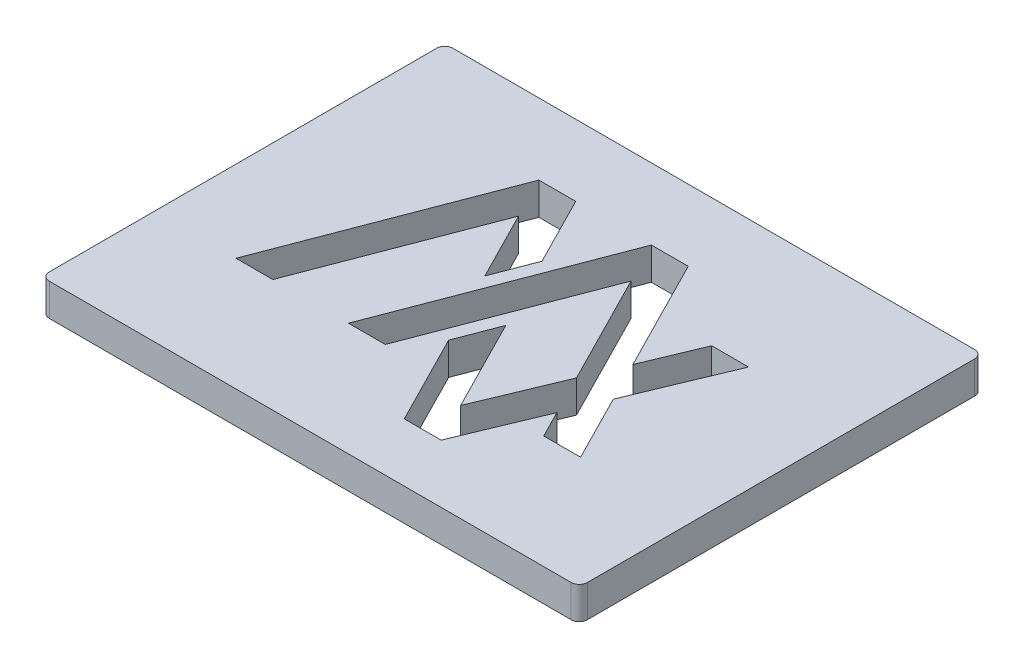
ISO-10303-21;
HEADER;
FILE_DESCRIPTION(('STEP AP214'),'2;1');
FILE_NAME('part.step','',(''),(''),'','','');
FILE_SCHEMA(('AUTOMOTIVE_DESIGN { 1 0 10303 214 1 1 1 1 }'));
ENDSEC;
DATA;
#1=APPLICATION_CONTEXT('core data for automotive mechanical design processes');
#2=APPLICATION_PROTOCOL_DEFINITION('international standard','automotive_design',2000,#1);
#3=PRODUCT_CONTEXT('',#1,'mechanical');
#4=PRODUCT('Part','Part','',(#3));
#5=PRODUCT_RELATED_PRODUCT_CATEGORY('part','',(#4));
#6=PRODUCT_DEFINITION_FORMATION('','',#4);
#7=PRODUCT_DEFINITION_CONTEXT('part definition',#1,'design');
#8=PRODUCT_DEFINITION('design','',#6,#7);
#9=PRODUCT_DEFINITION_SHAPE('','',#8);
#10=(LENGTH_UNIT() NAMED_UNIT(*) SI_UNIT(.MILLI.,.METRE.));
#11=(NAMED_UNIT(*) PLANE_ANGLE_UNIT() SI_UNIT($,.RADIAN.));
#12=(NAMED_UNIT(*) SI_UNIT($,.STERADIAN.) SOLID_ANGLE_UNIT());
#13=UNCERTAINTY_MEASURE_WITH_UNIT(LENGTH_MEASURE(1.E-05),#10,'distance_accuracy_value','');
#14=(GEOMETRIC_REPRESENTATION_CONTEXT(3) GLOBAL_UNCERTAINTY_ASSIGNED_CONTEXT((#13)) GLOBAL_UNIT_ASSIGNED_CONTEXT((#10,
#11,#12)) REPRESENTATION_CONTEXT('',''));
#15=CARTESIAN_POINT('',(0.,0.,0.));
#16=DIRECTION('',(0.,0.,1.));
#17=DIRECTION('',(1.,0.,0.));
#18=AXIS2_PLACEMENT_3D('',#15,#16,#17);
#19=CARTESIAN_POINT('',(97.,12.,-72.));
#20=DIRECTION('',(0.,-1.,0.));
#21=DIRECTION('',(0.,0.,-1.));
#22=AXIS2_PLACEMENT_3D('',#19,#20,#21);
#23=PLANE('',#22);
#24=DIRECTION('',(0.453552085785202,0.,0.891229771428162));
#25=VECTOR('',#24,1.);
#26=CARTESIAN_POINT('',(-0.117996716516434,12.,0.0600492247987563));
#27=LINE('',#26,#25);
#28=CARTESIAN_POINT('',(-24.8559068113444,12.,-48.5499399041352));
#29=VERTEX_POINT('',#28);
#30=CARTESIAN_POINT('',(-11.8569764432542,12.,-23.0070439416851));
#31=VERTEX_POINT('',#30);
#32=EDGE_CURVE('E135',#29,#31,#27,.T.);
#33=ORIENTED_EDGE('',*,*,#32,.T.);
#34=DIRECTION('',(-0.357011262554827,0.,0.934100079439569));
#35=VECTOR('',#34,1.);
#36=CARTESIAN_POINT('',(-18.0182080675893,12.,-6.88652463775086));
#37=LINE('',#36,#35);
#38=CARTESIAN_POINT('',(-17.7329616051894,12.,-7.63285611558958));
#39=VERTEX_POINT('',#38);
#40=EDGE_CURVE('E476',#31,#39,#37,.T.);
#41=ORIENTED_EDGE('',*,*,#40,.T.);
#42=DIRECTION('',(0.453552085785201,0.,0.891229771428162));
#43=VECTOR('',#42,1.);
#44=CARTESIAN_POINT('',(-10.999776641591,12.,5.5978511927068));
#45=LINE('',#44,#43);
#46=CARTESIAN_POINT('',(-30.7318919732795,12.,-33.1757520780395));
#47=VERTEX_POINT('',#46);
#48=EDGE_CURVE('E506',#47,#39,#45,.T.);
#49=ORIENTED_EDGE('',*,*,#48,.F.);
#50=DIRECTION('',(0.357011262554827,0.,-0.934100079439569));
#51=VECTOR('',#50,1.);
#52=CARTESIAN_POINT('',(-37.8784866971146,12.,-14.4770851186701));
#53=LINE('',#52,#51);
#54=CARTESIAN_POINT('',(-55.995225818357,12.,32.9243535116856));
#55=VERTEX_POINT('',#54);
#56=EDGE_CURVE('E503',#55,#47,#53,.T.);
#57=ORIENTED_EDGE('',*,*,#56,.F.);
#58=DIRECTION('',(1.,0.,0.));
#59=VECTOR('',#58,1.);
#60=CARTESIAN_POINT('',(0.,12.,32.9243535116856));
#61=LINE('',#60,#59);
#62=CARTESIAN_POINT('',(-69.695225818357,12.,32.9243535116856));
#63=VERTEX_POINT('',#62);
#64=EDGE_CURVE('E500',#63,#55,#61,.T.);
#65=ORIENTED_EDGE('',*,*,#64,.F.);
#66=DIRECTION('',(0.357011262554827,0.,-0.934100079439569));
#67=VECTOR('',#66,1.);
#68=CARTESIAN_POINT('',(-49.832325227318,12.,-19.0458193260421));
#69=LINE('',#68,#67);
#70=CARTESIAN_POINT('',(-38.5559068113443,12.,-48.5499399041352));
#71=VERTEX_POINT('',#70);
#72=EDGE_CURVE('E497',#63,#71,#69,.T.);
#73=ORIENTED_EDGE('',*,*,#72,.T.);
#74=DIRECTION('',(1.,0.,0.));
#75=VECTOR('',#74,1.);
#76=CARTESIAN_POINT('',(0.,12.,-48.5499399041352));
#77=LINE('',#76,#75);
#78=EDGE_CURVE('E494',#71,#29,#77,.T.);
#79=ORIENTED_EDGE('',*,*,#78,.T.);
#80=EDGE_LOOP('',(#33,#41,#49,#57,#65,#73,#79));
#81=FACE_BOUND('',#80,.T.);
#82=CARTESIAN_POINT('',(97.,12.,-72.));
#83=DIRECTION('',(0.,1.,0.));
#84=DIRECTION('',(0.,0.,-1.));
#85=AXIS2_PLACEMENT_3D('',#82,#83,#84);
#86=CIRCLE('',#85,3.);
#87=CARTESIAN_POINT('',(100.,12.,-72.));
#88=VERTEX_POINT('',#87);
#89=CARTESIAN_POINT('',(96.9999999999999,12.,-75.));
#90=VERTEX_POINT('',#89);
#91=EDGE_CURVE('E525',#88,#90,#86,.T.);
#92=ORIENTED_EDGE('',*,*,#91,.T.);
#93=DIRECTION('',(-1.,0.,0.));
#94=VECTOR('',#93,1.);
#95=CARTESIAN_POINT('',(-97.,12.,-75.));
#96=LINE('',#95,#94);
#97=CARTESIAN_POINT('',(-97.,12.,-75.));
#98=VERTEX_POINT('',#97);
#99=EDGE_CURVE('E528',#90,#98,#96,.T.);
#100=ORIENTED_EDGE('',*,*,#99,.T.);
#101=CARTESIAN_POINT('',(-97.,12.,-72.));
#102=DIRECTION('',(0.,1.,0.));
#103=DIRECTION('',(0.,0.,-1.));
#104=AXIS2_PLACEMENT_3D('',#101,#102,#103);
#105=CIRCLE('',#104,3.);
#106=CARTESIAN_POINT('',(-100.,12.,-72.));
#107=VERTEX_POINT('',#106);
#108=EDGE_CURVE('E531',#98,#107,#105,.T.);
#109=ORIENTED_EDGE('',*,*,#108,.T.);
#110=DIRECTION('',(0.,0.,1.));
#111=VECTOR('',#110,1.);
#112=CARTESIAN_POINT('',(-100.,12.,72.));
#113=LINE('',#112,#111);
#114=CARTESIAN_POINT('',(-100.,12.,72.));
#115=VERTEX_POINT('',#114);
#116=EDGE_CURVE('E533',#107,#115,#113,.T.);
#117=ORIENTED_EDGE('',*,*,#116,.T.);
#118=CARTESIAN_POINT('',(-97.,12.,72.));
#119=DIRECTION('',(0.,1.,0.));
#120=DIRECTION('',(0.,0.,-1.));
#121=AXIS2_PLACEMENT_3D('',#118,#119,#120);
#122=CIRCLE('',#121,3.);
#123=CARTESIAN_POINT('',(-97.,12.,75.));
#124=VERTEX_POINT('',#123);
#125=EDGE_CURVE('E535',#115,#124,#122,.T.);
#126=ORIENTED_EDGE('',*,*,#125,.T.);
#127=DIRECTION('',(1.,0.,0.));
#128=VECTOR('',#127,1.);
#129=CARTESIAN_POINT('',(-97.,12.,75.));
#130=LINE('',#129,#128);
#131=CARTESIAN_POINT('',(96.9999999999999,12.,75.));
#132=VERTEX_POINT('',#131);
#133=EDGE_CURVE('E537',#124,#132,#130,.T.);
#134=ORIENTED_EDGE('',*,*,#133,.T.);
#135=CARTESIAN_POINT('',(97.,12.,72.));
#136=DIRECTION('',(0.,1.,0.));
#137=DIRECTION('',(0.,0.,1.));
#138=AXIS2_PLACEMENT_3D('',#135,#136,#137);
#139=CIRCLE('',#138,3.);
#140=CARTESIAN_POINT('',(100.,12.,72.));
#141=VERTEX_POINT('',#140);
#142=EDGE_CURVE('E539',#132,#141,#139,.T.);
#143=ORIENTED_EDGE('',*,*,#142,.T.);
#144=DIRECTION('',(0.,0.,-1.));
#145=VECTOR('',#144,1.);
#146=CARTESIAN_POINT('',(100.,12.,72.));
#147=LINE('',#146,#145);
#148=EDGE_CURVE('E541',#141,#88,#147,.T.);
#149=ORIENTED_EDGE('',*,*,#148,.T.);
#150=EDGE_LOOP('',(#92,#100,#109,#117,#126,#134,#143,#149));
#151=FACE_BOUND('',#150,.T.);
#152=DIRECTION('',(0.453552085785202,0.,0.891229771428162));
#153=VECTOR('',#152,1.);
#154=CARTESIAN_POINT('',(33.094563240844,12.,-16.8420183742089));
#155=LINE('',#154,#153);
#156=CARTESIAN_POINT('',(45.8172414528804,12.,8.15804214858021));
#157=VERTEX_POINT('',#156);
#158=CARTESIAN_POINT('',(58.42096333926,12.,32.9243535116856));
#159=VERTEX_POINT('',#158);
#160=EDGE_CURVE('E127',#157,#159,#155,.T.);
#161=ORIENTED_EDGE('',*,*,#160,.T.);
#162=DIRECTION('',(1.,0.,0.));
#163=VECTOR('',#162,1.);
#164=CARTESIAN_POINT('',(0.,12.,32.9243535116856));
#165=LINE('',#164,#163);
#166=CARTESIAN_POINT('',(44.72096333926,12.,32.9243535116856));
#167=VERTEX_POINT('',#166);
#168=EDGE_CURVE('E350',#167,#159,#165,.T.);
#169=ORIENTED_EDGE('',*,*,#168,.F.);
#170=DIRECTION('',(0.453552085785202,0.,0.891229771428162));
#171=VECTOR('',#170,1.);
#172=CARTESIAN_POINT('',(22.2127833157694,12.,-11.3042164063008));
#173=LINE('',#172,#171);
#174=CARTESIAN_POINT('',(39.6515482353747,12.,22.9629536947529));
#175=VERTEX_POINT('',#174);
#176=EDGE_CURVE('E353',#175,#167,#173,.T.);
#177=ORIENTED_EDGE('',*,*,#176,.F.);
#178=DIRECTION('',(0.384454930284693,0.,-0.923143762682602));
#179=VECTOR('',#178,1.);
#180=CARTESIAN_POINT('',(41.9405445502991,12.,17.4666718045423));
#181=LINE('',#180,#179);
#182=CARTESIAN_POINT('',(26.9987708465014,12.,53.3444928741317));
#183=VERTEX_POINT('',#182);
#184=EDGE_CURVE('E435',#183,#175,#181,.T.);
#185=ORIENTED_EDGE('',*,*,#184,.F.);
#186=DIRECTION('',(1.,0.,0.));
#187=VECTOR('',#186,1.);
#188=CARTESIAN_POINT('',(0.,12.,53.3444928741317));
#189=LINE('',#188,#187);
#190=CARTESIAN_POINT('',(13.2987708465014,12.,53.3444928741317));
#191=VERTEX_POINT('',#190);
#192=EDGE_CURVE('E432',#191,#183,#189,.T.);
#193=ORIENTED_EDGE('',*,*,#192,.F.);
#194=DIRECTION('',(0.453552085785202,0.,0.891229771428162));
#195=VECTOR('',#194,1.);
#196=CARTESIAN_POINT('',(-10.999776641591,12.,5.5978511927068));
#197=LINE('',#196,#195);
#198=CARTESIAN_POINT('',(-3.79508395786317,12.,19.7550710908639));
#199=VERTEX_POINT('',#198);
#200=EDGE_CURVE('E429',#199,#191,#197,.T.);
#201=ORIENTED_EDGE('',*,*,#200,.F.);
#202=DIRECTION('',(-0.357011262554827,0.,0.934100079439569));
#203=VECTOR('',#202,1.);
#204=CARTESIAN_POINT('',(3.27663125700978,12.,1.2523221951694));
#205=LINE('',#204,#203);
#206=CARTESIAN_POINT('',(2.08090120407204,12.,4.38088326476839));
#207=VERTEX_POINT('',#206);
#208=EDGE_CURVE('E426',#207,#199,#205,.T.);
#209=ORIENTED_EDGE('',*,*,#208,.F.);
#210=DIRECTION('',(0.453552085785202,0.,0.891229771428162));
#211=VECTOR('',#210,1.);
#212=CARTESIAN_POINT('',(-0.117996716516432,12.,0.0600492247987554));
#213=LINE('',#212,#211);
#214=CARTESIAN_POINT('',(19.4644640640072,12.,38.5395813279591));
#215=VERTEX_POINT('',#214);
#216=EDGE_CURVE('E423',#207,#215,#213,.T.);
#217=ORIENTED_EDGE('',*,*,#216,.T.);
#218=DIRECTION('',(0.384454930284693,0.,-0.923143762682602));
#219=VECTOR('',#218,1.);
#220=CARTESIAN_POINT('',(30.2654811801559,12.,12.6044435628713));
#221=LINE('',#220,#219);
#222=CARTESIAN_POINT('',(32.1172414528804,12.,8.15804214858022));
#223=VERTEX_POINT('',#222);
#224=EDGE_CURVE('E420',#215,#223,#221,.T.);
#225=ORIENTED_EDGE('',*,*,#224,.T.);
#226=DIRECTION('',(0.453552085785202,0.,0.891229771428162));
#227=VECTOR('',#226,1.);
#228=CARTESIAN_POINT('',(22.2127833157694,12.,-11.3042164063008));
#229=LINE('',#228,#227);
#230=CARTESIAN_POINT('',(11.0822298476707,12.,-33.1757520780397));
#231=VERTEX_POINT('',#230);
#232=EDGE_CURVE('E417',#231,#223,#229,.T.);
#233=ORIENTED_EDGE('',*,*,#232,.F.);
#234=DIRECTION('',(0.357011262554827,0.,-0.934100079439569));
#235=VECTOR('',#234,1.);
#236=CARTESIAN_POINT('',(-1.39386914018807,12.,-0.532734117604737));
#237=LINE('',#236,#235);
#238=CARTESIAN_POINT('',(-14.1811039974068,12.,32.9243535116856));
#239=VERTEX_POINT('',#238);
#240=EDGE_CURVE('E414',#239,#231,#237,.T.);
#241=ORIENTED_EDGE('',*,*,#240,.F.);
#242=DIRECTION('',(1.,0.,0.));
#243=VECTOR('',#242,1.);
#244=CARTESIAN_POINT('',(0.,12.,32.9243535116856));
#245=LINE('',#244,#243);
#246=CARTESIAN_POINT('',(-27.8811039974068,12.,32.9243535116856));
#247=VERTEX_POINT('',#246);
#248=EDGE_CURVE('E411',#247,#239,#245,.T.);
#249=ORIENTED_EDGE('',*,*,#248,.F.);
#250=DIRECTION('',(0.357011262554827,0.,-0.934100079439569));
#251=VECTOR('',#250,1.);
#252=CARTESIAN_POINT('',(-13.3477076703915,12.,-5.10146832497673));
#253=LINE('',#252,#251);
#254=CARTESIAN_POINT('',(3.25821500960587,12.,-48.5499399041352));
#255=VERTEX_POINT('',#254);
#256=EDGE_CURVE('E408',#247,#255,#253,.T.);
#257=ORIENTED_EDGE('',*,*,#256,.T.);
#258=DIRECTION('',(1.,0.,0.));
#259=VECTOR('',#258,1.);
#260=CARTESIAN_POINT('',(0.,12.,-48.5499399041352));
#261=LINE('',#260,#259);
#262=CARTESIAN_POINT('',(16.9582150096059,12.,-48.5499399041352));
#263=VERTEX_POINT('',#262);
#264=EDGE_CURVE('E405',#255,#263,#261,.T.);
#265=ORIENTED_EDGE('',*,*,#264,.T.);
#266=DIRECTION('',(0.453552085785202,0.,0.891229771428162));
#267=VECTOR('',#266,1.);
#268=CARTESIAN_POINT('',(33.094563240844,12.,-16.8420183742089));
#269=LINE('',#268,#267);
#270=CARTESIAN_POINT('',(38.2829346703861,12.,-6.64686939759242));
#271=VERTEX_POINT('',#270);
#272=EDGE_CURVE('E402',#263,#271,#269,.T.);
#273=ORIENTED_EDGE('',*,*,#272,.T.);
#274=DIRECTION('',(0.384454930284694,0.,-0.923143762682602));
#275=VECTOR('',#274,1.);
#276=CARTESIAN_POINT('',(30.2654811801559,12.,12.6044435628713));
#277=LINE('',#276,#275);
#278=CARTESIAN_POINT('',(46.8992769107267,12.,-27.3362193570764));
#279=VERTEX_POINT('',#278);
#280=EDGE_CURVE('E399',#271,#279,#277,.T.);
#281=ORIENTED_EDGE('',*,*,#280,.T.);
#282=DIRECTION('',(1.,0.,0.));
#283=VECTOR('',#282,1.);
#284=CARTESIAN_POINT('',(0.,12.,-27.3362193570764));
#285=LINE('',#284,#283);
#286=CARTESIAN_POINT('',(60.5992769107267,12.,-27.3362193570764));
#287=VERTEX_POINT('',#286);
#288=EDGE_CURVE('E396',#279,#287,#285,.T.);
#289=ORIENTED_EDGE('',*,*,#288,.T.);
#290=DIRECTION('',(0.384454930284693,0.,-0.923143762682602));
#291=VECTOR('',#290,1.);
#292=CARTESIAN_POINT('',(41.9405445502991,12.,17.4666718045423));
#293=LINE('',#292,#291);
#294=EDGE_CURVE('E394',#157,#287,#293,.T.);
#295=ORIENTED_EDGE('',*,*,#294,.F.);
#296=EDGE_LOOP('',(#161,#169,#177,#185,#193,#201,#209,#217,#225,#233,#241,#249,#257,#265,#273,
#281,#289,#295));
#297=FACE_BOUND('',#296,.T.);
#298=ADVANCED_FACE('F112',(#81,#151,#297),#23,.F.);
#299=CARTESIAN_POINT('',(97.,0.,-72.));
#300=DIRECTION('',(0.,-1.,0.));
#301=DIRECTION('',(0.,0.,-1.));
#302=AXIS2_PLACEMENT_3D('',#299,#300,#301);
#303=PLANE('',#302);
#304=CARTESIAN_POINT('',(97.,0.,-72.));
#305=DIRECTION('',(0.,1.,0.));
#306=DIRECTION('',(0.,0.,-1.));
#307=AXIS2_PLACEMENT_3D('',#304,#305,#306);
#308=CIRCLE('',#307,3.);
#309=CARTESIAN_POINT('',(100.,0.,-72.));
#310=VERTEX_POINT('',#309);
#311=CARTESIAN_POINT('',(96.9999999999999,0.,-75.));
#312=VERTEX_POINT('',#311);
#313=EDGE_CURVE('E513',#310,#312,#308,.T.);
#314=ORIENTED_EDGE('',*,*,#313,.F.);
#315=DIRECTION('',(0.,0.,-1.));
#316=VECTOR('',#315,1.);
#317=CARTESIAN_POINT('',(100.,0.,72.));
#318=LINE('',#317,#316);
#319=CARTESIAN_POINT('',(100.,0.,72.));
#320=VERTEX_POINT('',#319);
#321=EDGE_CURVE('E529',#320,#310,#318,.T.);
#322=ORIENTED_EDGE('',*,*,#321,.F.);
#323=CARTESIAN_POINT('',(97.,0.,72.));
#324=DIRECTION('',(0.,1.,0.));
#325=DIRECTION('',(0.,0.,1.));
#326=AXIS2_PLACEMENT_3D('',#323,#324,#325);
#327=CIRCLE('',#326,3.);
#328=CARTESIAN_POINT('',(96.9999999999999,0.,75.));
#329=VERTEX_POINT('',#328);
#330=EDGE_CURVE('E556',#329,#320,#327,.T.);
#331=ORIENTED_EDGE('',*,*,#330,.F.);
#332=DIRECTION('',(1.,0.,0.));
#333=VECTOR('',#332,1.);
#334=CARTESIAN_POINT('',(-97.,0.,75.));
#335=LINE('',#334,#333);
#336=CARTESIAN_POINT('',(-97.,0.,75.));
#337=VERTEX_POINT('',#336);
#338=EDGE_CURVE('E554',#337,#329,#335,.T.);
#339=ORIENTED_EDGE('',*,*,#338,.F.);
#340=CARTESIAN_POINT('',(-97.,0.,72.));
#341=DIRECTION('',(0.,1.,0.));
#342=DIRECTION('',(0.,0.,-1.));
#343=AXIS2_PLACEMENT_3D('',#340,#341,#342);
#344=CIRCLE('',#343,3.);
#345=CARTESIAN_POINT('',(-100.,0.,72.));
#346=VERTEX_POINT('',#345);
#347=EDGE_CURVE('E552',#346,#337,#344,.T.);
#348=ORIENTED_EDGE('',*,*,#347,.F.);
#349=DIRECTION('',(0.,0.,1.));
#350=VECTOR('',#349,1.);
#351=CARTESIAN_POINT('',(-100.,0.,72.));
#352=LINE('',#351,#350);
#353=CARTESIAN_POINT('',(-100.,0.,-72.));
#354=VERTEX_POINT('',#353);
#355=EDGE_CURVE('E550',#354,#346,#352,.T.);
#356=ORIENTED_EDGE('',*,*,#355,.F.);
#357=CARTESIAN_POINT('',(-97.,0.,-72.));
#358=DIRECTION('',(0.,1.,0.));
#359=DIRECTION('',(0.,0.,-1.));
#360=AXIS2_PLACEMENT_3D('',#357,#358,#359);
#361=CIRCLE('',#360,3.);
#362=CARTESIAN_POINT('',(-97.,0.,-75.));
#363=VERTEX_POINT('',#362);
#364=EDGE_CURVE('E548',#363,#354,#361,.T.);
#365=ORIENTED_EDGE('',*,*,#364,.F.);
#366=DIRECTION('',(-1.,0.,0.));
#367=VECTOR('',#366,1.);
#368=CARTESIAN_POINT('',(-97.,0.,-75.));
#369=LINE('',#368,#367);
#370=EDGE_CURVE('E546',#312,#363,#369,.T.);
#371=ORIENTED_EDGE('',*,*,#370,.F.);
#372=EDGE_LOOP('',(#314,#322,#331,#339,#348,#356,#365,#371));
#373=FACE_BOUND('',#372,.T.);
#374=DIRECTION('',(-0.357011262554827,0.,0.934100079439569));
#375=VECTOR('',#374,1.);
#376=CARTESIAN_POINT('',(-18.0182080675893,0.,-6.88652463775086));
#377=LINE('',#376,#375);
#378=CARTESIAN_POINT('',(-11.8569764432542,0.,-23.0070439416851));
#379=VERTEX_POINT('',#378);
#380=CARTESIAN_POINT('',(-17.7329616051894,0.,-7.63285611558958));
#381=VERTEX_POINT('',#380);
#382=EDGE_CURVE('E490',#379,#381,#377,.T.);
#383=ORIENTED_EDGE('',*,*,#382,.F.);
#384=DIRECTION('',(0.453552085785202,0.,0.891229771428162));
#385=VECTOR('',#384,1.);
#386=CARTESIAN_POINT('',(-0.117996716516434,0.,0.0600492247987563));
#387=LINE('',#386,#385);
#388=CARTESIAN_POINT('',(-24.8559068113444,0.,-48.5499399041352));
#389=VERTEX_POINT('',#388);
#390=EDGE_CURVE('E473',#389,#379,#387,.T.);
#391=ORIENTED_EDGE('',*,*,#390,.F.);
#392=DIRECTION('',(1.,0.,0.));
#393=VECTOR('',#392,1.);
#394=CARTESIAN_POINT('',(0.,0.,-48.5499399041352));
#395=LINE('',#394,#393);
#396=CARTESIAN_POINT('',(-38.5559068113443,0.,-48.5499399041352));
#397=VERTEX_POINT('',#396);
#398=EDGE_CURVE('E475',#397,#389,#395,.T.);
#399=ORIENTED_EDGE('',*,*,#398,.F.);
#400=DIRECTION('',(0.357011262554827,0.,-0.934100079439569));
#401=VECTOR('',#400,1.);
#402=CARTESIAN_POINT('',(-49.832325227318,0.,-19.0458193260421));
#403=LINE('',#402,#401);
#404=CARTESIAN_POINT('',(-69.695225818357,0.,32.9243535116856));
#405=VERTEX_POINT('',#404);
#406=EDGE_CURVE('E478',#405,#397,#403,.T.);
#407=ORIENTED_EDGE('',*,*,#406,.F.);
#408=DIRECTION('',(1.,0.,0.));
#409=VECTOR('',#408,1.);
#410=CARTESIAN_POINT('',(0.,0.,32.9243535116856));
#411=LINE('',#410,#409);
#412=CARTESIAN_POINT('',(-55.995225818357,0.,32.9243535116856));
#413=VERTEX_POINT('',#412);
#414=EDGE_CURVE('E481',#405,#413,#411,.T.);
#415=ORIENTED_EDGE('',*,*,#414,.T.);
#416=DIRECTION('',(0.357011262554827,0.,-0.934100079439569));
#417=VECTOR('',#416,1.);
#418=CARTESIAN_POINT('',(-37.8784866971146,0.,-14.4770851186701));
#419=LINE('',#418,#417);
#420=CARTESIAN_POINT('',(-30.7318919732795,0.,-33.1757520780395));
#421=VERTEX_POINT('',#420);
#422=EDGE_CURVE('E484',#413,#421,#419,.T.);
#423=ORIENTED_EDGE('',*,*,#422,.T.);
#424=DIRECTION('',(0.453552085785201,0.,0.891229771428162));
#425=VECTOR('',#424,1.);
#426=CARTESIAN_POINT('',(-10.999776641591,0.,5.5978511927068));
#427=LINE('',#426,#425);
#428=EDGE_CURVE('E487',#421,#381,#427,.T.);
#429=ORIENTED_EDGE('',*,*,#428,.T.);
#430=EDGE_LOOP('',(#383,#391,#399,#407,#415,#423,#429));
#431=FACE_BOUND('',#430,.T.);
#432=DIRECTION('',(1.,0.,0.));
#433=VECTOR('',#432,1.);
#434=CARTESIAN_POINT('',(0.,0.,32.9243535116856));
#435=LINE('',#434,#433);
#436=CARTESIAN_POINT('',(44.72096333926,0.,32.9243535116856));
#437=VERTEX_POINT('',#436);
#438=CARTESIAN_POINT('',(58.42096333926,0.,32.9243535116856));
#439=VERTEX_POINT('',#438);
#440=EDGE_CURVE('E336',#437,#439,#435,.T.);
#441=ORIENTED_EDGE('',*,*,#440,.T.);
#442=DIRECTION('',(0.453552085785202,0.,0.891229771428162));
#443=VECTOR('',#442,1.);
#444=CARTESIAN_POINT('',(33.094563240844,0.,-16.8420183742089));
#445=LINE('',#444,#443);
#446=CARTESIAN_POINT('',(45.8172414528804,0.,8.15804214858021));
#447=VERTEX_POINT('',#446);
#448=EDGE_CURVE('E330',#447,#439,#445,.T.);
#449=ORIENTED_EDGE('',*,*,#448,.F.);
#450=DIRECTION('',(0.384454930284693,0.,-0.923143762682602));
#451=VECTOR('',#450,1.);
#452=CARTESIAN_POINT('',(41.9405445502991,0.,17.4666718045423));
#453=LINE('',#452,#451);
#454=CARTESIAN_POINT('',(60.5992769107267,0.,-27.3362193570764));
#455=VERTEX_POINT('',#454);
#456=EDGE_CURVE('E339',#447,#455,#453,.T.);
#457=ORIENTED_EDGE('',*,*,#456,.T.);
#458=DIRECTION('',(1.,0.,0.));
#459=VECTOR('',#458,1.);
#460=CARTESIAN_POINT('',(0.,0.,-27.3362193570764));
#461=LINE('',#460,#459);
#462=CARTESIAN_POINT('',(46.8992769107267,0.,-27.3362193570764));
#463=VERTEX_POINT('',#462);
#464=EDGE_CURVE('E344',#463,#455,#461,.T.);
#465=ORIENTED_EDGE('',*,*,#464,.F.);
#466=DIRECTION('',(0.384454930284694,0.,-0.923143762682602));
#467=VECTOR('',#466,1.);
#468=CARTESIAN_POINT('',(30.2654811801559,0.,12.6044435628713));
#469=LINE('',#468,#467);
#470=CARTESIAN_POINT('',(38.2829346703861,0.,-6.64686939759242));
#471=VERTEX_POINT('',#470);
#472=EDGE_CURVE('E357',#471,#463,#469,.T.);
#473=ORIENTED_EDGE('',*,*,#472,.F.);
#474=DIRECTION('',(0.453552085785202,0.,0.891229771428162));
#475=VECTOR('',#474,1.);
#476=CARTESIAN_POINT('',(33.094563240844,0.,-16.8420183742089));
#477=LINE('',#476,#475);
#478=CARTESIAN_POINT('',(16.9582150096059,0.,-48.5499399041352));
#479=VERTEX_POINT('',#478);
#480=EDGE_CURVE('E359',#479,#471,#477,.T.);
#481=ORIENTED_EDGE('',*,*,#480,.F.);
#482=DIRECTION('',(1.,0.,0.));
#483=VECTOR('',#482,1.);
#484=CARTESIAN_POINT('',(0.,0.,-48.5499399041352));
#485=LINE('',#484,#483);
#486=CARTESIAN_POINT('',(3.25821500960587,0.,-48.5499399041352));
#487=VERTEX_POINT('',#486);
#488=EDGE_CURVE('E361',#487,#479,#485,.T.);
#489=ORIENTED_EDGE('',*,*,#488,.F.);
#490=DIRECTION('',(0.357011262554827,0.,-0.934100079439569));
#491=VECTOR('',#490,1.);
#492=CARTESIAN_POINT('',(-13.3477076703915,0.,-5.10146832497673));
#493=LINE('',#492,#491);
#494=CARTESIAN_POINT('',(-27.8811039974068,0.,32.9243535116856));
#495=VERTEX_POINT('',#494);
#496=EDGE_CURVE('E363',#495,#487,#493,.T.);
#497=ORIENTED_EDGE('',*,*,#496,.F.);
#498=DIRECTION('',(1.,0.,0.));
#499=VECTOR('',#498,1.);
#500=CARTESIAN_POINT('',(0.,0.,32.9243535116856));
#501=LINE('',#500,#499);
#502=CARTESIAN_POINT('',(-14.1811039974068,0.,32.9243535116856));
#503=VERTEX_POINT('',#502);
#504=EDGE_CURVE('E365',#495,#503,#501,.T.);
#505=ORIENTED_EDGE('',*,*,#504,.T.);
#506=DIRECTION('',(0.357011262554827,0.,-0.934100079439569));
#507=VECTOR('',#506,1.);
#508=CARTESIAN_POINT('',(-1.39386914018807,0.,-0.532734117604737));
#509=LINE('',#508,#507);
#510=CARTESIAN_POINT('',(11.0822298476707,0.,-33.1757520780397));
#511=VERTEX_POINT('',#510);
#512=EDGE_CURVE('E368',#503,#511,#509,.T.);
#513=ORIENTED_EDGE('',*,*,#512,.T.);
#514=DIRECTION('',(0.453552085785202,0.,0.891229771428162));
#515=VECTOR('',#514,1.);
#516=CARTESIAN_POINT('',(22.2127833157694,0.,-11.3042164063008));
#517=LINE('',#516,#515);
#518=CARTESIAN_POINT('',(32.1172414528804,0.,8.15804214858022));
#519=VERTEX_POINT('',#518);
#520=EDGE_CURVE('E371',#511,#519,#517,.T.);
#521=ORIENTED_EDGE('',*,*,#520,.T.);
#522=DIRECTION('',(0.384454930284693,0.,-0.923143762682602));
#523=VECTOR('',#522,1.);
#524=CARTESIAN_POINT('',(30.2654811801559,0.,12.6044435628713));
#525=LINE('',#524,#523);
#526=CARTESIAN_POINT('',(19.4644640640072,0.,38.5395813279591));
#527=VERTEX_POINT('',#526);
#528=EDGE_CURVE('E374',#527,#519,#525,.T.);
#529=ORIENTED_EDGE('',*,*,#528,.F.);
#530=DIRECTION('',(0.453552085785202,0.,0.891229771428162));
#531=VECTOR('',#530,1.);
#532=CARTESIAN_POINT('',(-0.117996716516432,0.,0.0600492247987554));
#533=LINE('',#532,#531);
#534=CARTESIAN_POINT('',(2.08090120407204,0.,4.38088326476839));
#535=VERTEX_POINT('',#534);
#536=EDGE_CURVE('E376',#535,#527,#533,.T.);
#537=ORIENTED_EDGE('',*,*,#536,.F.);
#538=DIRECTION('',(-0.357011262554827,0.,0.934100079439569));
#539=VECTOR('',#538,1.);
#540=CARTESIAN_POINT('',(3.27663125700978,0.,1.2523221951694));
#541=LINE('',#540,#539);
#542=CARTESIAN_POINT('',(-3.79508395786317,0.,19.7550710908639));
#543=VERTEX_POINT('',#542);
#544=EDGE_CURVE('E378',#535,#543,#541,.T.);
#545=ORIENTED_EDGE('',*,*,#544,.T.);
#546=DIRECTION('',(0.453552085785202,0.,0.891229771428162));
#547=VECTOR('',#546,1.);
#548=CARTESIAN_POINT('',(-10.999776641591,0.,5.5978511927068));
#549=LINE('',#548,#547);
#550=CARTESIAN_POINT('',(13.2987708465014,0.,53.3444928741317));
#551=VERTEX_POINT('',#550);
#552=EDGE_CURVE('E381',#543,#551,#549,.T.);
#553=ORIENTED_EDGE('',*,*,#552,.T.);
#554=DIRECTION('',(1.,0.,0.));
#555=VECTOR('',#554,1.);
#556=CARTESIAN_POINT('',(0.,0.,53.3444928741317));
#557=LINE('',#556,#555);
#558=CARTESIAN_POINT('',(26.9987708465014,0.,53.3444928741317));
#559=VERTEX_POINT('',#558);
#560=EDGE_CURVE('E384',#551,#559,#557,.T.);
#561=ORIENTED_EDGE('',*,*,#560,.T.);
#562=DIRECTION('',(0.384454930284693,0.,-0.923143762682602));
#563=VECTOR('',#562,1.);
#564=CARTESIAN_POINT('',(41.9405445502991,0.,17.4666718045423));
#565=LINE('',#564,#563);
#566=CARTESIAN_POINT('',(39.6515482353747,0.,22.9629536947529));
#567=VERTEX_POINT('',#566);
#568=EDGE_CURVE('E387',#559,#567,#565,.T.);
#569=ORIENTED_EDGE('',*,*,#568,.T.);
#570=DIRECTION('',(0.453552085785202,0.,0.891229771428162));
#571=VECTOR('',#570,1.);
#572=CARTESIAN_POINT('',(22.2127833157694,0.,-11.3042164063008));
#573=LINE('',#572,#571);
#574=EDGE_CURVE('E390',#567,#437,#573,.T.);
#575=ORIENTED_EDGE('',*,*,#574,.T.);
#576=EDGE_LOOP('',(#441,#449,#457,#465,#473,#481,#489,#497,#505,#513,#521,#529,#537,#545,#553,
#561,#569,#575));
#577=FACE_BOUND('',#576,.T.);
#578=ADVANCED_FACE('F347',(#373,#431,#577),#303,.T.);
#579=CARTESIAN_POINT('',(97.,12.,-72.));
#580=DIRECTION('',(0.,-1.,0.));
#581=DIRECTION('',(0.,0.,-1.));
#582=AXIS2_PLACEMENT_3D('',#579,#580,#581);
#583=CYLINDRICAL_SURFACE('',#582,3.);
#584=ORIENTED_EDGE('',*,*,#313,.T.);
#585=DIRECTION('',(0.,-1.,0.));
#586=VECTOR('',#585,1.);
#587=CARTESIAN_POINT('',(96.9999999999999,12.,-75.));
#588=LINE('',#587,#586);
#589=EDGE_CURVE('E12',#90,#312,#588,.T.);
#590=ORIENTED_EDGE('',*,*,#589,.F.);
#591=ORIENTED_EDGE('',*,*,#91,.F.);
#592=DIRECTION('',(0.,-1.,0.));
#593=VECTOR('',#592,1.);
#594=CARTESIAN_POINT('',(100.,12.,-72.));
#595=LINE('',#594,#593);
#596=EDGE_CURVE('E543',#88,#310,#595,.T.);
#597=ORIENTED_EDGE('',*,*,#596,.T.);
#598=EDGE_LOOP('',(#584,#590,#591,#597));
#599=FACE_BOUND('',#598,.T.);
#600=ADVANCED_FACE('F114',(#599),#583,.T.);
#601=CARTESIAN_POINT('',(-97.,12.,-75.));
#602=DIRECTION('',(0.,0.,1.));
#603=DIRECTION('',(1.,0.,0.));
#604=AXIS2_PLACEMENT_3D('',#601,#602,#603);
#605=PLANE('',#604);
#606=ORIENTED_EDGE('',*,*,#370,.T.);
#607=DIRECTION('',(0.,-1.,0.));
#608=VECTOR('',#607,1.);
#609=CARTESIAN_POINT('',(-97.,12.,-75.));
#610=LINE('',#609,#608);
#611=EDGE_CURVE('E120',#98,#363,#610,.T.);
#612=ORIENTED_EDGE('',*,*,#611,.F.);
#613=ORIENTED_EDGE('',*,*,#99,.F.);
#614=ORIENTED_EDGE('',*,*,#589,.T.);
#615=EDGE_LOOP('',(#606,#612,#613,#614));
#616=FACE_BOUND('',#615,.T.);
#617=ADVANCED_FACE('F603',(#616),#605,.F.);
#618=CARTESIAN_POINT('',(-97.,12.,-72.));
#619=DIRECTION('',(0.,-1.,0.));
#620=DIRECTION('',(0.,0.,-1.));
#621=AXIS2_PLACEMENT_3D('',#618,#619,#620);
#622=CYLINDRICAL_SURFACE('',#621,3.);
#623=ORIENTED_EDGE('',*,*,#364,.T.);
#624=DIRECTION('',(0.,-1.,0.));
#625=VECTOR('',#624,1.);
#626=CARTESIAN_POINT('',(-100.,12.,-72.));
#627=LINE('',#626,#625);
#628=EDGE_CURVE('E573',#107,#354,#627,.T.);
#629=ORIENTED_EDGE('',*,*,#628,.F.);
#630=ORIENTED_EDGE('',*,*,#108,.F.);
#631=ORIENTED_EDGE('',*,*,#611,.T.);
#632=EDGE_LOOP('',(#623,#629,#630,#631));
#633=FACE_BOUND('',#632,.T.);
#634=ADVANCED_FACE('F580',(#633),#622,.T.);
#635=CARTESIAN_POINT('',(-100.,12.,72.));
#636=DIRECTION('',(1.,0.,0.));
#637=DIRECTION('',(0.,0.,-1.));
#638=AXIS2_PLACEMENT_3D('',#635,#636,#637);
#639=PLANE('',#638);
#640=ORIENTED_EDGE('',*,*,#355,.T.);
#641=DIRECTION('',(0.,-1.,0.));
#642=VECTOR('',#641,1.);
#643=CARTESIAN_POINT('',(-100.,12.,72.));
#644=LINE('',#643,#642);
#645=EDGE_CURVE('E570',#115,#346,#644,.T.);
#646=ORIENTED_EDGE('',*,*,#645,.F.);
#647=ORIENTED_EDGE('',*,*,#116,.F.);
#648=ORIENTED_EDGE('',*,*,#628,.T.);
#649=EDGE_LOOP('',(#640,#646,#647,#648));
#650=FACE_BOUND('',#649,.T.);
#651=ADVANCED_FACE('F591',(#650),#639,.F.);
#652=CARTESIAN_POINT('',(-97.,12.,72.));
#653=DIRECTION('',(0.,-1.,0.));
#654=DIRECTION('',(0.,0.,-1.));
#655=AXIS2_PLACEMENT_3D('',#652,#653,#654);
#656=CYLINDRICAL_SURFACE('',#655,3.);
#657=ORIENTED_EDGE('',*,*,#347,.T.);
#658=DIRECTION('',(0.,-1.,0.));
#659=VECTOR('',#658,1.);
#660=CARTESIAN_POINT('',(-97.,12.,75.));
#661=LINE('',#660,#659);
#662=EDGE_CURVE('E567',#124,#337,#661,.T.);
#663=ORIENTED_EDGE('',*,*,#662,.F.);
#664=ORIENTED_EDGE('',*,*,#125,.F.);
#665=ORIENTED_EDGE('',*,*,#645,.T.);
#666=EDGE_LOOP('',(#657,#663,#664,#665));
#667=FACE_BOUND('',#666,.T.);
#668=ADVANCED_FACE('F595',(#667),#656,.T.);
#669=CARTESIAN_POINT('',(-97.,12.,75.));
#670=DIRECTION('',(0.,0.,-1.));
#671=DIRECTION('',(-1.,0.,0.));
#672=AXIS2_PLACEMENT_3D('',#669,#670,#671);
#673=PLANE('',#672);
#674=ORIENTED_EDGE('',*,*,#338,.T.);
#675=DIRECTION('',(0.,-1.,0.));
#676=VECTOR('',#675,1.);
#677=CARTESIAN_POINT('',(96.9999999999999,12.,75.));
#678=LINE('',#677,#676);
#679=EDGE_CURVE('E564',#132,#329,#678,.T.);
#680=ORIENTED_EDGE('',*,*,#679,.F.);
#681=ORIENTED_EDGE('',*,*,#133,.F.);
#682=ORIENTED_EDGE('',*,*,#662,.T.);
#683=EDGE_LOOP('',(#674,#680,#681,#682));
#684=FACE_BOUND('',#683,.T.);
#685=ADVANCED_FACE('F616',(#684),#673,.F.);
#686=CARTESIAN_POINT('',(97.,12.,72.));
#687=DIRECTION('',(0.,-1.,0.));
#688=DIRECTION('',(0.,0.,-1.));
#689=AXIS2_PLACEMENT_3D('',#686,#687,#688);
#690=CYLINDRICAL_SURFACE('',#689,3.);
#691=ORIENTED_EDGE('',*,*,#330,.T.);
#692=DIRECTION('',(0.,-1.,0.));
#693=VECTOR('',#692,1.);
#694=CARTESIAN_POINT('',(100.,12.,72.));
#695=LINE('',#694,#693);
#696=EDGE_CURVE('E561',#141,#320,#695,.T.);
#697=ORIENTED_EDGE('',*,*,#696,.F.);
#698=ORIENTED_EDGE('',*,*,#142,.F.);
#699=ORIENTED_EDGE('',*,*,#679,.T.);
#700=EDGE_LOOP('',(#691,#697,#698,#699));
#701=FACE_BOUND('',#700,.T.);
#702=ADVANCED_FACE('F614',(#701),#690,.T.);
#703=CARTESIAN_POINT('',(100.,12.,72.));
#704=DIRECTION('',(-1.,0.,0.));
#705=DIRECTION('',(0.,0.,1.));
#706=AXIS2_PLACEMENT_3D('',#703,#704,#705);
#707=PLANE('',#706);
#708=ORIENTED_EDGE('',*,*,#321,.T.);
#709=ORIENTED_EDGE('',*,*,#596,.F.);
#710=ORIENTED_EDGE('',*,*,#148,.F.);
#711=ORIENTED_EDGE('',*,*,#696,.T.);
#712=EDGE_LOOP('',(#708,#709,#710,#711));
#713=FACE_BOUND('',#712,.T.);
#714=ADVANCED_FACE('F609',(#713),#707,.F.);
#715=CARTESIAN_POINT('',(-0.117996716516434,0.,0.0600492247987563));
#716=DIRECTION('',(-0.891229771428162,0.,0.453552085785201));
#717=DIRECTION('',(0.453552085785201,0.,0.891229771428162));
#718=AXIS2_PLACEMENT_3D('',#715,#716,#717);
#719=PLANE('',#718);
#720=ORIENTED_EDGE('',*,*,#32,.F.);
#721=DIRECTION('',(0.,1.,0.));
#722=VECTOR('',#721,1.);
#723=CARTESIAN_POINT('',(-24.8559068113444,0.,-48.5499399041352));
#724=LINE('',#723,#722);
#725=EDGE_CURVE('E492',#389,#29,#724,.T.);
#726=ORIENTED_EDGE('',*,*,#725,.F.);
#727=ORIENTED_EDGE('',*,*,#390,.T.);
#728=DIRECTION('',(0.,1.,0.));
#729=VECTOR('',#728,1.);
#730=CARTESIAN_POINT('',(-11.8569764432542,0.,-23.0070439416851));
#731=LINE('',#730,#729);
#732=EDGE_CURVE('E511',#379,#31,#731,.T.);
#733=ORIENTED_EDGE('',*,*,#732,.T.);
#734=EDGE_LOOP('',(#720,#726,#727,#733));
#735=FACE_BOUND('',#734,.T.);
#736=ADVANCED_FACE('F633',(#735),#719,.T.);
#737=CARTESIAN_POINT('',(-18.0182080675893,0.,-6.88652463775086));
#738=DIRECTION('',(-0.934100079439569,0.,-0.357011262554827));
#739=DIRECTION('',(-0.357011262554827,0.,0.934100079439569));
#740=AXIS2_PLACEMENT_3D('',#737,#738,#739);
#741=PLANE('',#740);
#742=ORIENTED_EDGE('',*,*,#40,.F.);
#743=ORIENTED_EDGE('',*,*,#732,.F.);
#744=ORIENTED_EDGE('',*,*,#382,.T.);
#745=DIRECTION('',(0.,1.,0.));
#746=VECTOR('',#745,1.);
#747=CARTESIAN_POINT('',(-17.7329616051894,0.,-7.63285611558958));
#748=LINE('',#747,#746);
#749=EDGE_CURVE('E514',#381,#39,#748,.T.);
#750=ORIENTED_EDGE('',*,*,#749,.T.);
#751=EDGE_LOOP('',(#742,#743,#744,#750));
#752=FACE_BOUND('',#751,.T.);
#753=ADVANCED_FACE('F640',(#752),#741,.T.);
#754=CARTESIAN_POINT('',(-10.999776641591,0.,5.5978511927068));
#755=DIRECTION('',(-0.891229771428162,0.,0.453552085785201));
#756=DIRECTION('',(0.453552085785202,0.,0.891229771428162));
#757=AXIS2_PLACEMENT_3D('',#754,#755,#756);
#758=PLANE('',#757);
#759=ORIENTED_EDGE('',*,*,#48,.T.);
#760=ORIENTED_EDGE('',*,*,#749,.F.);
#761=ORIENTED_EDGE('',*,*,#428,.F.);
#762=DIRECTION('',(0.,1.,0.));
#763=VECTOR('',#762,1.);
#764=CARTESIAN_POINT('',(-30.7318919732795,0.,-33.1757520780395));
#765=LINE('',#764,#763);
#766=EDGE_CURVE('E516',#421,#47,#765,.T.);
#767=ORIENTED_EDGE('',*,*,#766,.T.);
#768=EDGE_LOOP('',(#759,#760,#761,#767));
#769=FACE_BOUND('',#768,.T.);
#770=ADVANCED_FACE('F644',(#769),#758,.F.);
#771=CARTESIAN_POINT('',(-37.8784866971146,0.,-14.4770851186701));
#772=DIRECTION('',(0.934100079439569,0.,0.357011262554827));
#773=DIRECTION('',(0.357011262554827,0.,-0.934100079439569));
#774=AXIS2_PLACEMENT_3D('',#771,#772,#773);
#775=PLANE('',#774);
#776=ORIENTED_EDGE('',*,*,#56,.T.);
#777=ORIENTED_EDGE('',*,*,#766,.F.);
#778=ORIENTED_EDGE('',*,*,#422,.F.);
#779=DIRECTION('',(0.,1.,0.));
#780=VECTOR('',#779,1.);
#781=CARTESIAN_POINT('',(-55.995225818357,0.,32.9243535116856));
#782=LINE('',#781,#780);
#783=EDGE_CURVE('E518',#413,#55,#782,.T.);
#784=ORIENTED_EDGE('',*,*,#783,.T.);
#785=EDGE_LOOP('',(#776,#777,#778,#784));
#786=FACE_BOUND('',#785,.T.);
#787=ADVANCED_FACE('F650',(#786),#775,.F.);
#788=CARTESIAN_POINT('',(0.,0.,32.9243535116856));
#789=DIRECTION('',(0.,0.,1.));
#790=DIRECTION('',(1.,0.,0.));
#791=AXIS2_PLACEMENT_3D('',#788,#789,#790);
#792=PLANE('',#791);
#793=ORIENTED_EDGE('',*,*,#64,.T.);
#794=ORIENTED_EDGE('',*,*,#783,.F.);
#795=ORIENTED_EDGE('',*,*,#414,.F.);
#796=DIRECTION('',(0.,1.,0.));
#797=VECTOR('',#796,1.);
#798=CARTESIAN_POINT('',(-69.695225818357,0.,32.9243535116856));
#799=LINE('',#798,#797);
#800=EDGE_CURVE('E520',#405,#63,#799,.T.);
#801=ORIENTED_EDGE('',*,*,#800,.T.);
#802=EDGE_LOOP('',(#793,#794,#795,#801));
#803=FACE_BOUND('',#802,.T.);
#804=ADVANCED_FACE('F658',(#803),#792,.F.);
#805=CARTESIAN_POINT('',(-49.832325227318,0.,-19.0458193260421));
#806=DIRECTION('',(0.934100079439569,0.,0.357011262554827));
#807=DIRECTION('',(0.357011262554827,0.,-0.934100079439569));
#808=AXIS2_PLACEMENT_3D('',#805,#806,#807);
#809=PLANE('',#808);
#810=ORIENTED_EDGE('',*,*,#72,.F.);
#811=ORIENTED_EDGE('',*,*,#800,.F.);
#812=ORIENTED_EDGE('',*,*,#406,.T.);
#813=DIRECTION('',(0.,1.,0.));
#814=VECTOR('',#813,1.);
#815=CARTESIAN_POINT('',(-38.5559068113443,0.,-48.5499399041352));
#816=LINE('',#815,#814);
#817=EDGE_CURVE('E522',#397,#71,#816,.T.);
#818=ORIENTED_EDGE('',*,*,#817,.T.);
#819=EDGE_LOOP('',(#810,#811,#812,#818));
#820=FACE_BOUND('',#819,.T.);
#821=ADVANCED_FACE('F662',(#820),#809,.T.);
#822=CARTESIAN_POINT('',(0.,0.,-48.5499399041352));
#823=DIRECTION('',(0.,0.,1.));
#824=DIRECTION('',(1.,0.,0.));
#825=AXIS2_PLACEMENT_3D('',#822,#823,#824);
#826=PLANE('',#825);
#827=ORIENTED_EDGE('',*,*,#78,.F.);
#828=ORIENTED_EDGE('',*,*,#817,.F.);
#829=ORIENTED_EDGE('',*,*,#398,.T.);
#830=ORIENTED_EDGE('',*,*,#725,.T.);
#831=EDGE_LOOP('',(#827,#828,#829,#830));
#832=FACE_BOUND('',#831,.T.);
#833=ADVANCED_FACE('F665',(#832),#826,.T.);
#834=CARTESIAN_POINT('',(33.094563240844,0.,-16.8420183742089));
#835=DIRECTION('',(-0.891229771428162,0.,0.453552085785201));
#836=DIRECTION('',(0.453552085785201,0.,0.891229771428162));
#837=AXIS2_PLACEMENT_3D('',#834,#835,#836);
#838=PLANE('',#837);
#839=ORIENTED_EDGE('',*,*,#160,.F.);
#840=DIRECTION('',(0.,1.,0.));
#841=VECTOR('',#840,1.);
#842=CARTESIAN_POINT('',(45.8172414528804,0.,8.15804214858021));
#843=LINE('',#842,#841);
#844=EDGE_CURVE('E326',#447,#157,#843,.T.);
#845=ORIENTED_EDGE('',*,*,#844,.F.);
#846=ORIENTED_EDGE('',*,*,#448,.T.);
#847=DIRECTION('',(0.,1.,0.));
#848=VECTOR('',#847,1.);
#849=CARTESIAN_POINT('',(58.42096333926,0.,32.9243535116856));
#850=LINE('',#849,#848);
#851=EDGE_CURVE('E440',#439,#159,#850,.T.);
#852=ORIENTED_EDGE('',*,*,#851,.T.);
#853=EDGE_LOOP('',(#839,#845,#846,#852));
#854=FACE_BOUND('',#853,.T.);
#855=ADVANCED_FACE('F328',(#854),#838,.T.);
#856=CARTESIAN_POINT('',(0.,0.,32.9243535116856));
#857=DIRECTION('',(0.,0.,1.));
#858=DIRECTION('',(1.,0.,0.));
#859=AXIS2_PLACEMENT_3D('',#856,#857,#858);
#860=PLANE('',#859);
#861=ORIENTED_EDGE('',*,*,#168,.T.);
#862=ORIENTED_EDGE('',*,*,#851,.F.);
#863=ORIENTED_EDGE('',*,*,#440,.F.);
#864=DIRECTION('',(0.,1.,0.));
#865=VECTOR('',#864,1.);
#866=CARTESIAN_POINT('',(44.72096333926,0.,32.9243535116856));
#867=LINE('',#866,#865);
#868=EDGE_CURVE('E442',#437,#167,#867,.T.);
#869=ORIENTED_EDGE('',*,*,#868,.T.);
#870=EDGE_LOOP('',(#861,#862,#863,#869));
#871=FACE_BOUND('',#870,.T.);
#872=ADVANCED_FACE('F672',(#871),#860,.F.);
#873=CARTESIAN_POINT('',(22.2127833157694,0.,-11.3042164063008));
#874=DIRECTION('',(-0.891229771428162,0.,0.453552085785201));
#875=DIRECTION('',(0.453552085785202,0.,0.891229771428162));
#876=AXIS2_PLACEMENT_3D('',#873,#874,#875);
#877=PLANE('',#876);
#878=ORIENTED_EDGE('',*,*,#176,.T.);
#879=ORIENTED_EDGE('',*,*,#868,.F.);
#880=ORIENTED_EDGE('',*,*,#574,.F.);
#881=DIRECTION('',(0.,1.,0.));
#882=VECTOR('',#881,1.);
#883=CARTESIAN_POINT('',(39.6515482353747,0.,22.9629536947529));
#884=LINE('',#883,#882);
#885=EDGE_CURVE('E444',#567,#175,#884,.T.);
#886=ORIENTED_EDGE('',*,*,#885,.T.);
#887=EDGE_LOOP('',(#878,#879,#880,#886));
#888=FACE_BOUND('',#887,.T.);
#889=ADVANCED_FACE('F690',(#888),#877,.F.);
#890=CARTESIAN_POINT('',(41.9405445502991,0.,17.4666718045423));
#891=DIRECTION('',(0.923143762682602,0.,0.384454930284693));
#892=DIRECTION('',(0.384454930284693,0.,-0.923143762682602));
#893=AXIS2_PLACEMENT_3D('',#890,#891,#892);
#894=PLANE('',#893);
#895=ORIENTED_EDGE('',*,*,#184,.T.);
#896=ORIENTED_EDGE('',*,*,#885,.F.);
#897=ORIENTED_EDGE('',*,*,#568,.F.);
#898=DIRECTION('',(0.,1.,0.));
#899=VECTOR('',#898,1.);
#900=CARTESIAN_POINT('',(26.9987708465014,0.,53.3444928741317));
#901=LINE('',#900,#899);
#902=EDGE_CURVE('E446',#559,#183,#901,.T.);
#903=ORIENTED_EDGE('',*,*,#902,.T.);
#904=EDGE_LOOP('',(#895,#896,#897,#903));
#905=FACE_BOUND('',#904,.T.);
#906=ADVANCED_FACE('F696',(#905),#894,.F.);
#907=CARTESIAN_POINT('',(0.,0.,53.3444928741317));
#908=DIRECTION('',(0.,0.,1.));
#909=DIRECTION('',(1.,0.,0.));
#910=AXIS2_PLACEMENT_3D('',#907,#908,#909);
#911=PLANE('',#910);
#912=ORIENTED_EDGE('',*,*,#192,.T.);
#913=ORIENTED_EDGE('',*,*,#902,.F.);
#914=ORIENTED_EDGE('',*,*,#560,.F.);
#915=DIRECTION('',(0.,1.,0.));
#916=VECTOR('',#915,1.);
#917=CARTESIAN_POINT('',(13.2987708465014,0.,53.3444928741317));
#918=LINE('',#917,#916);
#919=EDGE_CURVE('E448',#551,#191,#918,.T.);
#920=ORIENTED_EDGE('',*,*,#919,.T.);
#921=EDGE_LOOP('',(#912,#913,#914,#920));
#922=FACE_BOUND('',#921,.T.);
#923=ADVANCED_FACE('F702',(#922),#911,.F.);
#924=CARTESIAN_POINT('',(-10.999776641591,0.,5.5978511927068));
#925=DIRECTION('',(-0.891229771428162,0.,0.453552085785201));
#926=DIRECTION('',(0.453552085785202,0.,0.891229771428162));
#927=AXIS2_PLACEMENT_3D('',#924,#925,#926);
#928=PLANE('',#927);
#929=ORIENTED_EDGE('',*,*,#200,.T.);
#930=ORIENTED_EDGE('',*,*,#919,.F.);
#931=ORIENTED_EDGE('',*,*,#552,.F.);
#932=DIRECTION('',(0.,1.,0.));
#933=VECTOR('',#932,1.);
#934=CARTESIAN_POINT('',(-3.79508395786317,0.,19.7550710908639));
#935=LINE('',#934,#933);
#936=EDGE_CURVE('E450',#543,#199,#935,.T.);
#937=ORIENTED_EDGE('',*,*,#936,.T.);
#938=EDGE_LOOP('',(#929,#930,#931,#937));
#939=FACE_BOUND('',#938,.T.);
#940=ADVANCED_FACE('F706',(#939),#928,.F.);
#941=CARTESIAN_POINT('',(3.27663125700978,0.,1.2523221951694));
#942=DIRECTION('',(-0.934100079439569,0.,-0.357011262554827));
#943=DIRECTION('',(-0.357011262554827,0.,0.934100079439569));
#944=AXIS2_PLACEMENT_3D('',#941,#942,#943);
#945=PLANE('',#944);
#946=ORIENTED_EDGE('',*,*,#208,.T.);
#947=ORIENTED_EDGE('',*,*,#936,.F.);
#948=ORIENTED_EDGE('',*,*,#544,.F.);
#949=DIRECTION('',(0.,1.,0.));
#950=VECTOR('',#949,1.);
#951=CARTESIAN_POINT('',(2.08090120407204,0.,4.38088326476839));
#952=LINE('',#951,#950);
#953=EDGE_CURVE('E452',#535,#207,#952,.T.);
#954=ORIENTED_EDGE('',*,*,#953,.T.);
#955=EDGE_LOOP('',(#946,#947,#948,#954));
#956=FACE_BOUND('',#955,.T.);
#957=ADVANCED_FACE('F710',(#956),#945,.F.);
#958=CARTESIAN_POINT('',(-0.117996716516432,0.,0.0600492247987554));
#959=DIRECTION('',(-0.891229771428162,0.,0.453552085785201));
#960=DIRECTION('',(0.453552085785202,0.,0.891229771428162));
#961=AXIS2_PLACEMENT_3D('',#958,#959,#960);
#962=PLANE('',#961);
#963=ORIENTED_EDGE('',*,*,#216,.F.);
#964=ORIENTED_EDGE('',*,*,#953,.F.);
#965=ORIENTED_EDGE('',*,*,#536,.T.);
#966=DIRECTION('',(0.,1.,0.));
#967=VECTOR('',#966,1.);
#968=CARTESIAN_POINT('',(19.4644640640072,0.,38.5395813279591));
#969=LINE('',#968,#967);
#970=EDGE_CURVE('E454',#527,#215,#969,.T.);
#971=ORIENTED_EDGE('',*,*,#970,.T.);
#972=EDGE_LOOP('',(#963,#964,#965,#971));
#973=FACE_BOUND('',#972,.T.);
#974=ADVANCED_FACE('F714',(#973),#962,.T.);
#975=CARTESIAN_POINT('',(30.2654811801559,0.,12.6044435628713));
#976=DIRECTION('',(0.923143762682602,0.,0.384454930284693));
#977=DIRECTION('',(0.384454930284693,0.,-0.923143762682602));
#978=AXIS2_PLACEMENT_3D('',#975,#976,#977);
#979=PLANE('',#978);
#980=ORIENTED_EDGE('',*,*,#224,.F.);
#981=ORIENTED_EDGE('',*,*,#970,.F.);
#982=ORIENTED_EDGE('',*,*,#528,.T.);
#983=DIRECTION('',(0.,1.,0.));
#984=VECTOR('',#983,1.);
#985=CARTESIAN_POINT('',(32.1172414528804,0.,8.15804214858022));
#986=LINE('',#985,#984);
#987=EDGE_CURVE('E456',#519,#223,#986,.T.);
#988=ORIENTED_EDGE('',*,*,#987,.T.);
#989=EDGE_LOOP('',(#980,#981,#982,#988));
#990=FACE_BOUND('',#989,.T.);
#991=ADVANCED_FACE('F718',(#990),#979,.T.);
#992=CARTESIAN_POINT('',(22.2127833157694,0.,-11.3042164063008));
#993=DIRECTION('',(-0.891229771428162,0.,0.453552085785201));
#994=DIRECTION('',(0.453552085785201,0.,0.891229771428162));
#995=AXIS2_PLACEMENT_3D('',#992,#993,#994);
#996=PLANE('',#995);
#997=ORIENTED_EDGE('',*,*,#232,.T.);
#998=ORIENTED_EDGE('',*,*,#987,.F.);
#999=ORIENTED_EDGE('',*,*,#520,.F.);
#1000=DIRECTION('',(0.,1.,0.));
#1001=VECTOR('',#1000,1.);
#1002=CARTESIAN_POINT('',(11.0822298476707,0.,-33.1757520780397));
#1003=LINE('',#1002,#1001);
#1004=EDGE_CURVE('E458',#511,#231,#1003,.T.);
#1005=ORIENTED_EDGE('',*,*,#1004,.T.);
#1006=EDGE_LOOP('',(#997,#998,#999,#1005));
#1007=FACE_BOUND('',#1006,.T.);
#1008=ADVANCED_FACE('F722',(#1007),#996,.F.);
#1009=CARTESIAN_POINT('',(-1.39386914018807,0.,-0.532734117604737));
#1010=DIRECTION('',(0.934100079439569,0.,0.357011262554827));
#1011=DIRECTION('',(0.357011262554827,0.,-0.934100079439569));
#1012=AXIS2_PLACEMENT_3D('',#1009,#1010,#1011);
#1013=PLANE('',#1012);
#1014=ORIENTED_EDGE('',*,*,#240,.T.);
#1015=ORIENTED_EDGE('',*,*,#1004,.F.);
#1016=ORIENTED_EDGE('',*,*,#512,.F.);
#1017=DIRECTION('',(0.,1.,0.));
#1018=VECTOR('',#1017,1.);
#1019=CARTESIAN_POINT('',(-14.1811039974068,0.,32.9243535116856));
#1020=LINE('',#1019,#1018);
#1021=EDGE_CURVE('E460',#503,#239,#1020,.T.);
#1022=ORIENTED_EDGE('',*,*,#1021,.T.);
#1023=EDGE_LOOP('',(#1014,#1015,#1016,#1022));
#1024=FACE_BOUND('',#1023,.T.);
#1025=ADVANCED_FACE('F726',(#1024),#1013,.F.);
#1026=CARTESIAN_POINT('',(0.,0.,32.9243535116856));
#1027=DIRECTION('',(0.,0.,1.));
#1028=DIRECTION('',(1.,0.,0.));
#1029=AXIS2_PLACEMENT_3D('',#1026,#1027,#1028);
#1030=PLANE('',#1029);
#1031=ORIENTED_EDGE('',*,*,#248,.T.);
#1032=ORIENTED_EDGE('',*,*,#1021,.F.);
#1033=ORIENTED_EDGE('',*,*,#504,.F.);
#1034=DIRECTION('',(0.,1.,0.));
#1035=VECTOR('',#1034,1.);
#1036=CARTESIAN_POINT('',(-27.8811039974068,0.,32.9243535116856));
#1037=LINE('',#1036,#1035);
#1038=EDGE_CURVE('E462',#495,#247,#1037,.T.);
#1039=ORIENTED_EDGE('',*,*,#1038,.T.);
#1040=EDGE_LOOP('',(#1031,#1032,#1033,#1039));
#1041=FACE_BOUND('',#1040,.T.);
#1042=ADVANCED_FACE('F730',(#1041),#1030,.F.);
#1043=CARTESIAN_POINT('',(-13.3477076703915,0.,-5.10146832497673));
#1044=DIRECTION('',(0.934100079439569,0.,0.357011262554827));
#1045=DIRECTION('',(0.357011262554827,0.,-0.934100079439569));
#1046=AXIS2_PLACEMENT_3D('',#1043,#1044,#1045);
#1047=PLANE('',#1046);
#1048=ORIENTED_EDGE('',*,*,#256,.F.);
#1049=ORIENTED_EDGE('',*,*,#1038,.F.);
#1050=ORIENTED_EDGE('',*,*,#496,.T.);
#1051=DIRECTION('',(0.,1.,0.));
#1052=VECTOR('',#1051,1.);
#1053=CARTESIAN_POINT('',(3.25821500960587,0.,-48.5499399041352));
#1054=LINE('',#1053,#1052);
#1055=EDGE_CURVE('E464',#487,#255,#1054,.T.);
#1056=ORIENTED_EDGE('',*,*,#1055,.T.);
#1057=EDGE_LOOP('',(#1048,#1049,#1050,#1056));
#1058=FACE_BOUND('',#1057,.T.);
#1059=ADVANCED_FACE('F734',(#1058),#1047,.T.);
#1060=CARTESIAN_POINT('',(0.,0.,-48.5499399041352));
#1061=DIRECTION('',(0.,0.,1.));
#1062=DIRECTION('',(1.,0.,0.));
#1063=AXIS2_PLACEMENT_3D('',#1060,#1061,#1062);
#1064=PLANE('',#1063);
#1065=ORIENTED_EDGE('',*,*,#264,.F.);
#1066=ORIENTED_EDGE('',*,*,#1055,.F.);
#1067=ORIENTED_EDGE('',*,*,#488,.T.);
#1068=DIRECTION('',(0.,1.,0.));
#1069=VECTOR('',#1068,1.);
#1070=CARTESIAN_POINT('',(16.9582150096059,0.,-48.5499399041352));
#1071=LINE('',#1070,#1069);
#1072=EDGE_CURVE('E466',#479,#263,#1071,.T.);
#1073=ORIENTED_EDGE('',*,*,#1072,.T.);
#1074=EDGE_LOOP('',(#1065,#1066,#1067,#1073));
#1075=FACE_BOUND('',#1074,.T.);
#1076=ADVANCED_FACE('F738',(#1075),#1064,.T.);
#1077=CARTESIAN_POINT('',(33.094563240844,0.,-16.8420183742089));
#1078=DIRECTION('',(-0.891229771428162,0.,0.453552085785201));
#1079=DIRECTION('',(0.453552085785201,0.,0.891229771428162));
#1080=AXIS2_PLACEMENT_3D('',#1077,#1078,#1079);
#1081=PLANE('',#1080);
#1082=ORIENTED_EDGE('',*,*,#272,.F.);
#1083=ORIENTED_EDGE('',*,*,#1072,.F.);
#1084=ORIENTED_EDGE('',*,*,#480,.T.);
#1085=DIRECTION('',(0.,1.,0.));
#1086=VECTOR('',#1085,1.);
#1087=CARTESIAN_POINT('',(38.2829346703861,0.,-6.64686939759242));
#1088=LINE('',#1087,#1086);
#1089=EDGE_CURVE('E468',#471,#271,#1088,.T.);
#1090=ORIENTED_EDGE('',*,*,#1089,.T.);
#1091=EDGE_LOOP('',(#1082,#1083,#1084,#1090));
#1092=FACE_BOUND('',#1091,.T.);
#1093=ADVANCED_FACE('F742',(#1092),#1081,.T.);
#1094=CARTESIAN_POINT('',(30.2654811801559,0.,12.6044435628713));
#1095=DIRECTION('',(0.923143762682601,0.,0.384454930284694));
#1096=DIRECTION('',(0.384454930284694,0.,-0.923143762682602));
#1097=AXIS2_PLACEMENT_3D('',#1094,#1095,#1096);
#1098=PLANE('',#1097);
#1099=ORIENTED_EDGE('',*,*,#280,.F.);
#1100=ORIENTED_EDGE('',*,*,#1089,.F.);
#1101=ORIENTED_EDGE('',*,*,#472,.T.);
#1102=DIRECTION('',(0.,1.,0.));
#1103=VECTOR('',#1102,1.);
#1104=CARTESIAN_POINT('',(46.8992769107267,0.,-27.3362193570764));
#1105=LINE('',#1104,#1103);
#1106=EDGE_CURVE('E470',#463,#279,#1105,.T.);
#1107=ORIENTED_EDGE('',*,*,#1106,.T.);
#1108=EDGE_LOOP('',(#1099,#1100,#1101,#1107));
#1109=FACE_BOUND('',#1108,.T.);
#1110=ADVANCED_FACE('F746',(#1109),#1098,.T.);
#1111=CARTESIAN_POINT('',(0.,0.,-27.3362193570764));
#1112=DIRECTION('',(0.,0.,1.));
#1113=DIRECTION('',(1.,0.,0.));
#1114=AXIS2_PLACEMENT_3D('',#1111,#1112,#1113);
#1115=PLANE('',#1114);
#1116=ORIENTED_EDGE('',*,*,#288,.F.);
#1117=ORIENTED_EDGE('',*,*,#1106,.F.);
#1118=ORIENTED_EDGE('',*,*,#464,.T.);
#1119=DIRECTION('',(0.,1.,0.));
#1120=VECTOR('',#1119,1.);
#1121=CARTESIAN_POINT('',(60.5992769107267,0.,-27.3362193570764));
#1122=LINE('',#1121,#1120);
#1123=EDGE_CURVE('E335',#455,#287,#1122,.T.);
#1124=ORIENTED_EDGE('',*,*,#1123,.T.);
#1125=EDGE_LOOP('',(#1116,#1117,#1118,#1124));
#1126=FACE_BOUND('',#1125,.T.);
#1127=ADVANCED_FACE('F750',(#1126),#1115,.T.);
#1128=CARTESIAN_POINT('',(41.9405445502991,0.,17.4666718045423));
#1129=DIRECTION('',(0.923143762682602,0.,0.384454930284693));
#1130=DIRECTION('',(0.384454930284693,0.,-0.923143762682602));
#1131=AXIS2_PLACEMENT_3D('',#1128,#1129,#1130);
#1132=PLANE('',#1131);
#1133=ORIENTED_EDGE('',*,*,#294,.T.);
#1134=ORIENTED_EDGE('',*,*,#1123,.F.);
#1135=ORIENTED_EDGE('',*,*,#456,.F.);
#1136=ORIENTED_EDGE('',*,*,#844,.T.);
#1137=EDGE_LOOP('',(#1133,#1134,#1135,#1136));
#1138=FACE_BOUND('',#1137,.T.);
#1139=ADVANCED_FACE('F340',(#1138),#1132,.F.);
#1140=CLOSED_SHELL('',(#298,#578,#600,#617,#634,#651,#668,#685,#702,#714,#736,#753,#770,#787,
#804,#821,#833,#855,#872,#889,#906,#923,#940,#957,#974,#991,#1008,#1025,#1042,#1059,#1076,#1093,
#1110,#1127,#1139));
#1141=MANIFOLD_SOLID_BREP('B2',#1140);
#1142=ADVANCED_BREP_SHAPE_REPRESENTATION('',(#18,#1141),#14);
#1143=SHAPE_DEFINITION_REPRESENTATION(#9,#1142);
ENDSEC;
END-ISO-10303-21;
